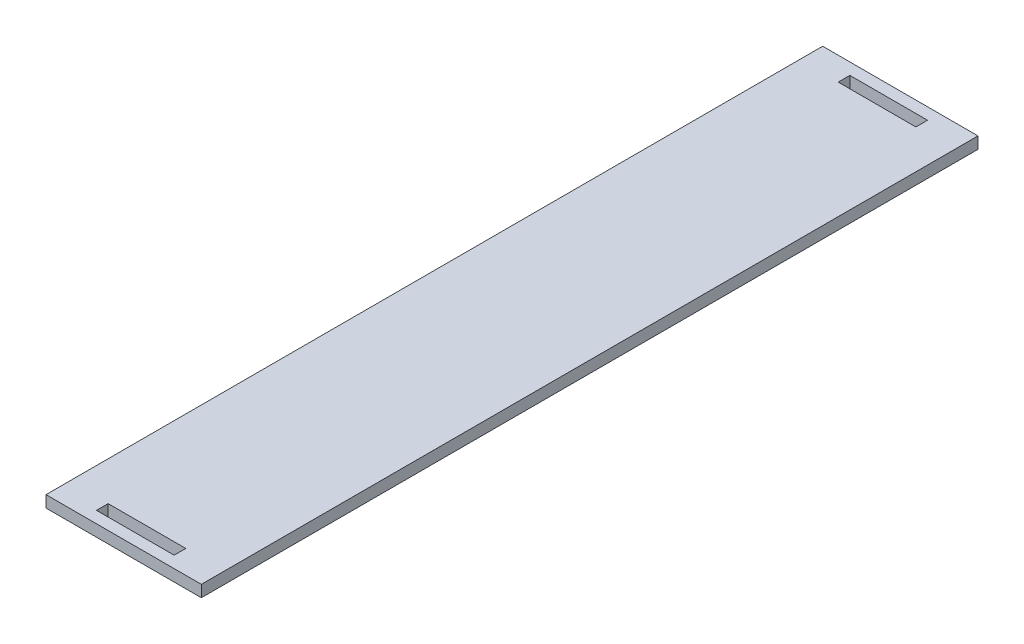
ISO-10303-21;
HEADER;
FILE_DESCRIPTION(('STEP AP214'),'2;1');
FILE_NAME('part.step','',(''),(''),'','','');
FILE_SCHEMA(('AUTOMOTIVE_DESIGN { 1 0 10303 214 1 1 1 1 }'));
ENDSEC;
DATA;
#1=APPLICATION_CONTEXT('core data for automotive mechanical design processes');
#2=APPLICATION_PROTOCOL_DEFINITION('international standard','automotive_design',2000,#1);
#3=PRODUCT_CONTEXT('',#1,'mechanical');
#4=PRODUCT('Part','Part','',(#3));
#5=PRODUCT_RELATED_PRODUCT_CATEGORY('part','',(#4));
#6=PRODUCT_DEFINITION_FORMATION('','',#4);
#7=PRODUCT_DEFINITION_CONTEXT('part definition',#1,'design');
#8=PRODUCT_DEFINITION('design','',#6,#7);
#9=PRODUCT_DEFINITION_SHAPE('','',#8);
#10=(LENGTH_UNIT() NAMED_UNIT(*) SI_UNIT(.MILLI.,.METRE.));
#11=(NAMED_UNIT(*) PLANE_ANGLE_UNIT() SI_UNIT($,.RADIAN.));
#12=(NAMED_UNIT(*) SI_UNIT($,.STERADIAN.) SOLID_ANGLE_UNIT());
#13=UNCERTAINTY_MEASURE_WITH_UNIT(LENGTH_MEASURE(1.E-05),#10,'distance_accuracy_value','');
#14=(GEOMETRIC_REPRESENTATION_CONTEXT(3) GLOBAL_UNCERTAINTY_ASSIGNED_CONTEXT((#13)) GLOBAL_UNIT_ASSIGNED_CONTEXT((#10,
#11,#12)) REPRESENTATION_CONTEXT('',''));
#15=CARTESIAN_POINT('',(0.,0.,0.));
#16=DIRECTION('',(0.,0.,1.));
#17=DIRECTION('',(1.,0.,0.));
#18=AXIS2_PLACEMENT_3D('',#15,#16,#17);
#19=CARTESIAN_POINT('',(0.,3.,0.));
#20=DIRECTION('',(0.,-1.,0.));
#21=DIRECTION('',(0.,0.,-1.));
#22=AXIS2_PLACEMENT_3D('',#19,#20,#21);
#23=PLANE('',#22);
#24=DIRECTION('',(0.,0.,1.));
#25=VECTOR('',#24,1.);
#26=CARTESIAN_POINT('',(-10.,3.,94.));
#27=LINE('',#26,#25);
#28=CARTESIAN_POINT('',(-10.,3.,94.));
#29=VERTEX_POINT('',#28);
#30=CARTESIAN_POINT('',(-10.,3.,97.));
#31=VERTEX_POINT('',#30);
#32=EDGE_CURVE('E164',#29,#31,#27,.T.);
#33=ORIENTED_EDGE('',*,*,#32,.F.);
#34=DIRECTION('',(-1.,0.,0.));
#35=VECTOR('',#34,1.);
#36=CARTESIAN_POINT('',(9.99999999999997,3.,94.));
#37=LINE('',#36,#35);
#38=CARTESIAN_POINT('',(9.99999999999997,3.,94.));
#39=VERTEX_POINT('',#38);
#40=EDGE_CURVE('E172',#39,#29,#37,.T.);
#41=ORIENTED_EDGE('',*,*,#40,.F.);
#42=DIRECTION('',(0.,0.,-1.));
#43=VECTOR('',#42,1.);
#44=CARTESIAN_POINT('',(9.99999999999997,3.,94.));
#45=LINE('',#44,#43);
#46=CARTESIAN_POINT('',(9.99999999999997,3.,97.));
#47=VERTEX_POINT('',#46);
#48=EDGE_CURVE('E169',#47,#39,#45,.T.);
#49=ORIENTED_EDGE('',*,*,#48,.F.);
#50=DIRECTION('',(1.,0.,0.));
#51=VECTOR('',#50,1.);
#52=CARTESIAN_POINT('',(9.99999999999997,3.,97.));
#53=LINE('',#52,#51);
#54=EDGE_CURVE('E166',#31,#47,#53,.T.);
#55=ORIENTED_EDGE('',*,*,#54,.F.);
#56=EDGE_LOOP('',(#33,#41,#49,#55));
#57=FACE_BOUND('',#56,.T.);
#58=DIRECTION('',(0.,0.,1.));
#59=VECTOR('',#58,1.);
#60=CARTESIAN_POINT('',(-20.,3.,-100.));
#61=LINE('',#60,#59);
#62=CARTESIAN_POINT('',(-20.,3.,-100.));
#63=VERTEX_POINT('',#62);
#64=CARTESIAN_POINT('',(-20.,3.,100.));
#65=VERTEX_POINT('',#64);
#66=EDGE_CURVE('E195',#63,#65,#61,.T.);
#67=ORIENTED_EDGE('',*,*,#66,.T.);
#68=DIRECTION('',(1.,0.,0.));
#69=VECTOR('',#68,1.);
#70=CARTESIAN_POINT('',(20.,3.,100.));
#71=LINE('',#70,#69);
#72=CARTESIAN_POINT('',(20.,3.,100.));
#73=VERTEX_POINT('',#72);
#74=EDGE_CURVE('E198',#65,#73,#71,.T.);
#75=ORIENTED_EDGE('',*,*,#74,.T.);
#76=DIRECTION('',(0.,0.,-1.));
#77=VECTOR('',#76,1.);
#78=CARTESIAN_POINT('',(20.,3.,-100.));
#79=LINE('',#78,#77);
#80=CARTESIAN_POINT('',(20.,3.,-100.));
#81=VERTEX_POINT('',#80);
#82=EDGE_CURVE('E201',#73,#81,#79,.T.);
#83=ORIENTED_EDGE('',*,*,#82,.T.);
#84=DIRECTION('',(-1.,0.,0.));
#85=VECTOR('',#84,1.);
#86=CARTESIAN_POINT('',(20.,3.,-100.));
#87=LINE('',#86,#85);
#88=EDGE_CURVE('E203',#81,#63,#87,.T.);
#89=ORIENTED_EDGE('',*,*,#88,.T.);
#90=EDGE_LOOP('',(#67,#75,#83,#89));
#91=FACE_BOUND('',#90,.T.);
#92=DIRECTION('',(0.,0.,-1.));
#93=VECTOR('',#92,1.);
#94=CARTESIAN_POINT('',(10.0000000000001,3.,-94.));
#95=LINE('',#94,#93);
#96=CARTESIAN_POINT('',(10.0000000000001,3.,-94.));
#97=VERTEX_POINT('',#96);
#98=CARTESIAN_POINT('',(10.0000000000001,3.,-97.));
#99=VERTEX_POINT('',#98);
#100=EDGE_CURVE('E128',#97,#99,#95,.T.);
#101=ORIENTED_EDGE('',*,*,#100,.F.);
#102=DIRECTION('',(1.,0.,0.));
#103=VECTOR('',#102,1.);
#104=CARTESIAN_POINT('',(10.0000000000001,3.,-94.));
#105=LINE('',#104,#103);
#106=CARTESIAN_POINT('',(-9.9999999999999,3.,-94.));
#107=VERTEX_POINT('',#106);
#108=EDGE_CURVE('E150',#107,#97,#105,.T.);
#109=ORIENTED_EDGE('',*,*,#108,.F.);
#110=DIRECTION('',(0.,0.,1.));
#111=VECTOR('',#110,1.);
#112=CARTESIAN_POINT('',(-9.9999999999999,3.,-94.));
#113=LINE('',#112,#111);
#114=CARTESIAN_POINT('',(-9.99999999999989,3.,-97.));
#115=VERTEX_POINT('',#114);
#116=EDGE_CURVE('E148',#115,#107,#113,.T.);
#117=ORIENTED_EDGE('',*,*,#116,.F.);
#118=DIRECTION('',(-1.,0.,0.));
#119=VECTOR('',#118,1.);
#120=CARTESIAN_POINT('',(10.0000000000001,3.,-97.));
#121=LINE('',#120,#119);
#122=EDGE_CURVE('E136',#99,#115,#121,.T.);
#123=ORIENTED_EDGE('',*,*,#122,.F.);
#124=EDGE_LOOP('',(#101,#109,#117,#123));
#125=FACE_BOUND('',#124,.T.);
#126=ADVANCED_FACE('F39',(#57,#91,#125),#23,.F.);
#127=CARTESIAN_POINT('',(0.,0.,0.));
#128=DIRECTION('',(0.,-1.,0.));
#129=DIRECTION('',(0.,0.,-1.));
#130=AXIS2_PLACEMENT_3D('',#127,#128,#129);
#131=PLANE('',#130);
#132=DIRECTION('',(0.,0.,1.));
#133=VECTOR('',#132,1.);
#134=CARTESIAN_POINT('',(-20.,0.,-100.));
#135=LINE('',#134,#133);
#136=CARTESIAN_POINT('',(-20.,0.,-100.));
#137=VERTEX_POINT('',#136);
#138=CARTESIAN_POINT('',(-20.,0.,100.));
#139=VERTEX_POINT('',#138);
#140=EDGE_CURVE('E194',#137,#139,#135,.T.);
#141=ORIENTED_EDGE('',*,*,#140,.F.);
#142=DIRECTION('',(-1.,0.,0.));
#143=VECTOR('',#142,1.);
#144=CARTESIAN_POINT('',(20.,0.,-100.));
#145=LINE('',#144,#143);
#146=CARTESIAN_POINT('',(20.,0.,-100.));
#147=VERTEX_POINT('',#146);
#148=EDGE_CURVE('E199',#147,#137,#145,.T.);
#149=ORIENTED_EDGE('',*,*,#148,.F.);
#150=DIRECTION('',(0.,0.,-1.));
#151=VECTOR('',#150,1.);
#152=CARTESIAN_POINT('',(20.,0.,-100.));
#153=LINE('',#152,#151);
#154=CARTESIAN_POINT('',(20.,0.,100.));
#155=VERTEX_POINT('',#154);
#156=EDGE_CURVE('E210',#155,#147,#153,.T.);
#157=ORIENTED_EDGE('',*,*,#156,.F.);
#158=DIRECTION('',(1.,0.,0.));
#159=VECTOR('',#158,1.);
#160=CARTESIAN_POINT('',(20.,0.,100.));
#161=LINE('',#160,#159);
#162=EDGE_CURVE('E208',#139,#155,#161,.T.);
#163=ORIENTED_EDGE('',*,*,#162,.F.);
#164=EDGE_LOOP('',(#141,#149,#157,#163));
#165=FACE_BOUND('',#164,.T.);
#166=DIRECTION('',(-1.,0.,0.));
#167=VECTOR('',#166,1.);
#168=CARTESIAN_POINT('',(9.99999999999997,0.,94.));
#169=LINE('',#168,#167);
#170=CARTESIAN_POINT('',(9.99999999999997,0.,94.));
#171=VERTEX_POINT('',#170);
#172=CARTESIAN_POINT('',(-10.,0.,94.));
#173=VERTEX_POINT('',#172);
#174=EDGE_CURVE('E167',#171,#173,#169,.T.);
#175=ORIENTED_EDGE('',*,*,#174,.T.);
#176=DIRECTION('',(0.,0.,1.));
#177=VECTOR('',#176,1.);
#178=CARTESIAN_POINT('',(-10.,0.,94.));
#179=LINE('',#178,#177);
#180=CARTESIAN_POINT('',(-10.,0.,97.));
#181=VERTEX_POINT('',#180);
#182=EDGE_CURVE('E144',#173,#181,#179,.T.);
#183=ORIENTED_EDGE('',*,*,#182,.T.);
#184=DIRECTION('',(1.,0.,0.));
#185=VECTOR('',#184,1.);
#186=CARTESIAN_POINT('',(9.99999999999997,0.,97.));
#187=LINE('',#186,#185);
#188=CARTESIAN_POINT('',(9.99999999999997,0.,97.));
#189=VERTEX_POINT('',#188);
#190=EDGE_CURVE('E177',#181,#189,#187,.T.);
#191=ORIENTED_EDGE('',*,*,#190,.T.);
#192=DIRECTION('',(0.,0.,-1.));
#193=VECTOR('',#192,1.);
#194=CARTESIAN_POINT('',(9.99999999999997,0.,94.));
#195=LINE('',#194,#193);
#196=EDGE_CURVE('E180',#189,#171,#195,.T.);
#197=ORIENTED_EDGE('',*,*,#196,.T.);
#198=EDGE_LOOP('',(#175,#183,#191,#197));
#199=FACE_BOUND('',#198,.T.);
#200=DIRECTION('',(1.,0.,0.));
#201=VECTOR('',#200,1.);
#202=CARTESIAN_POINT('',(10.0000000000001,0.,-94.));
#203=LINE('',#202,#201);
#204=CARTESIAN_POINT('',(-9.9999999999999,0.,-94.));
#205=VERTEX_POINT('',#204);
#206=CARTESIAN_POINT('',(10.0000000000001,0.,-94.));
#207=VERTEX_POINT('',#206);
#208=EDGE_CURVE('E137',#205,#207,#203,.T.);
#209=ORIENTED_EDGE('',*,*,#208,.T.);
#210=DIRECTION('',(0.,0.,-1.));
#211=VECTOR('',#210,1.);
#212=CARTESIAN_POINT('',(10.0000000000001,0.,-94.));
#213=LINE('',#212,#211);
#214=CARTESIAN_POINT('',(10.0000000000001,0.,-97.));
#215=VERTEX_POINT('',#214);
#216=EDGE_CURVE('E62',#207,#215,#213,.T.);
#217=ORIENTED_EDGE('',*,*,#216,.T.);
#218=DIRECTION('',(-1.,0.,0.));
#219=VECTOR('',#218,1.);
#220=CARTESIAN_POINT('',(10.0000000000001,0.,-97.));
#221=LINE('',#220,#219);
#222=CARTESIAN_POINT('',(-9.99999999999989,0.,-97.));
#223=VERTEX_POINT('',#222);
#224=EDGE_CURVE('E143',#215,#223,#221,.T.);
#225=ORIENTED_EDGE('',*,*,#224,.T.);
#226=DIRECTION('',(0.,0.,1.));
#227=VECTOR('',#226,1.);
#228=CARTESIAN_POINT('',(-9.9999999999999,0.,-94.));
#229=LINE('',#228,#227);
#230=EDGE_CURVE('E156',#223,#205,#229,.T.);
#231=ORIENTED_EDGE('',*,*,#230,.T.);
#232=EDGE_LOOP('',(#209,#217,#225,#231));
#233=FACE_BOUND('',#232,.T.);
#234=ADVANCED_FACE('F228',(#165,#199,#233),#131,.T.);
#235=CARTESIAN_POINT('',(-20.,3.,-100.));
#236=DIRECTION('',(1.,0.,0.));
#237=DIRECTION('',(0.,0.,-1.));
#238=AXIS2_PLACEMENT_3D('',#235,#236,#237);
#239=PLANE('',#238);
#240=ORIENTED_EDGE('',*,*,#140,.T.);
#241=DIRECTION('',(0.,-1.,0.));
#242=VECTOR('',#241,1.);
#243=CARTESIAN_POINT('',(-20.,3.,100.));
#244=LINE('',#243,#242);
#245=EDGE_CURVE('E11',#65,#139,#244,.T.);
#246=ORIENTED_EDGE('',*,*,#245,.F.);
#247=ORIENTED_EDGE('',*,*,#66,.F.);
#248=DIRECTION('',(0.,-1.,0.));
#249=VECTOR('',#248,1.);
#250=CARTESIAN_POINT('',(-20.,3.,-100.));
#251=LINE('',#250,#249);
#252=EDGE_CURVE('E205',#63,#137,#251,.T.);
#253=ORIENTED_EDGE('',*,*,#252,.T.);
#254=EDGE_LOOP('',(#240,#246,#247,#253));
#255=FACE_BOUND('',#254,.T.);
#256=ADVANCED_FACE('F41',(#255),#239,.F.);
#257=CARTESIAN_POINT('',(20.,3.,100.));
#258=DIRECTION('',(0.,0.,-1.));
#259=DIRECTION('',(-1.,0.,0.));
#260=AXIS2_PLACEMENT_3D('',#257,#258,#259);
#261=PLANE('',#260);
#262=ORIENTED_EDGE('',*,*,#162,.T.);
#263=DIRECTION('',(0.,-1.,0.));
#264=VECTOR('',#263,1.);
#265=CARTESIAN_POINT('',(20.,3.,100.));
#266=LINE('',#265,#264);
#267=EDGE_CURVE('E47',#73,#155,#266,.T.);
#268=ORIENTED_EDGE('',*,*,#267,.F.);
#269=ORIENTED_EDGE('',*,*,#74,.F.);
#270=ORIENTED_EDGE('',*,*,#245,.T.);
#271=EDGE_LOOP('',(#262,#268,#269,#270));
#272=FACE_BOUND('',#271,.T.);
#273=ADVANCED_FACE('F238',(#272),#261,.F.);
#274=CARTESIAN_POINT('',(20.,3.,-100.));
#275=DIRECTION('',(-1.,0.,0.));
#276=DIRECTION('',(0.,0.,1.));
#277=AXIS2_PLACEMENT_3D('',#274,#275,#276);
#278=PLANE('',#277);
#279=ORIENTED_EDGE('',*,*,#156,.T.);
#280=DIRECTION('',(0.,-1.,0.));
#281=VECTOR('',#280,1.);
#282=CARTESIAN_POINT('',(20.,3.,-100.));
#283=LINE('',#282,#281);
#284=EDGE_CURVE('E215',#81,#147,#283,.T.);
#285=ORIENTED_EDGE('',*,*,#284,.F.);
#286=ORIENTED_EDGE('',*,*,#82,.F.);
#287=ORIENTED_EDGE('',*,*,#267,.T.);
#288=EDGE_LOOP('',(#279,#285,#286,#287));
#289=FACE_BOUND('',#288,.T.);
#290=ADVANCED_FACE('F222',(#289),#278,.F.);
#291=CARTESIAN_POINT('',(20.,3.,-100.));
#292=DIRECTION('',(0.,0.,1.));
#293=DIRECTION('',(1.,0.,0.));
#294=AXIS2_PLACEMENT_3D('',#291,#292,#293);
#295=PLANE('',#294);
#296=ORIENTED_EDGE('',*,*,#148,.T.);
#297=ORIENTED_EDGE('',*,*,#252,.F.);
#298=ORIENTED_EDGE('',*,*,#88,.F.);
#299=ORIENTED_EDGE('',*,*,#284,.T.);
#300=EDGE_LOOP('',(#296,#297,#298,#299));
#301=FACE_BOUND('',#300,.T.);
#302=ADVANCED_FACE('F232',(#301),#295,.F.);
#303=CARTESIAN_POINT('',(-10.,3.,94.));
#304=DIRECTION('',(1.,0.,0.));
#305=DIRECTION('',(0.,0.,-1.));
#306=AXIS2_PLACEMENT_3D('',#303,#304,#305);
#307=PLANE('',#306);
#308=ORIENTED_EDGE('',*,*,#182,.F.);
#309=DIRECTION('',(0.,-1.,0.));
#310=VECTOR('',#309,1.);
#311=CARTESIAN_POINT('',(-10.,3.,94.));
#312=LINE('',#311,#310);
#313=EDGE_CURVE('E174',#29,#173,#312,.T.);
#314=ORIENTED_EDGE('',*,*,#313,.F.);
#315=ORIENTED_EDGE('',*,*,#32,.T.);
#316=DIRECTION('',(0.,-1.,0.));
#317=VECTOR('',#316,1.);
#318=CARTESIAN_POINT('',(-10.,3.,97.));
#319=LINE('',#318,#317);
#320=EDGE_CURVE('E191',#31,#181,#319,.T.);
#321=ORIENTED_EDGE('',*,*,#320,.T.);
#322=EDGE_LOOP('',(#308,#314,#315,#321));
#323=FACE_BOUND('',#322,.T.);
#324=ADVANCED_FACE('F254',(#323),#307,.T.);
#325=CARTESIAN_POINT('',(9.99999999999997,3.,97.));
#326=DIRECTION('',(0.,0.,-1.));
#327=DIRECTION('',(-1.,0.,0.));
#328=AXIS2_PLACEMENT_3D('',#325,#326,#327);
#329=PLANE('',#328);
#330=ORIENTED_EDGE('',*,*,#190,.F.);
#331=ORIENTED_EDGE('',*,*,#320,.F.);
#332=ORIENTED_EDGE('',*,*,#54,.T.);
#333=DIRECTION('',(0.,-1.,0.));
#334=VECTOR('',#333,1.);
#335=CARTESIAN_POINT('',(9.99999999999997,3.,97.));
#336=LINE('',#335,#334);
#337=EDGE_CURVE('E189',#47,#189,#336,.T.);
#338=ORIENTED_EDGE('',*,*,#337,.T.);
#339=EDGE_LOOP('',(#330,#331,#332,#338));
#340=FACE_BOUND('',#339,.T.);
#341=ADVANCED_FACE('F261',(#340),#329,.T.);
#342=CARTESIAN_POINT('',(9.99999999999997,3.,94.));
#343=DIRECTION('',(-1.,0.,0.));
#344=DIRECTION('',(0.,0.,1.));
#345=AXIS2_PLACEMENT_3D('',#342,#343,#344);
#346=PLANE('',#345);
#347=ORIENTED_EDGE('',*,*,#196,.F.);
#348=ORIENTED_EDGE('',*,*,#337,.F.);
#349=ORIENTED_EDGE('',*,*,#48,.T.);
#350=DIRECTION('',(0.,-1.,0.));
#351=VECTOR('',#350,1.);
#352=CARTESIAN_POINT('',(9.99999999999997,3.,94.));
#353=LINE('',#352,#351);
#354=EDGE_CURVE('E187',#39,#171,#353,.T.);
#355=ORIENTED_EDGE('',*,*,#354,.T.);
#356=EDGE_LOOP('',(#347,#348,#349,#355));
#357=FACE_BOUND('',#356,.T.);
#358=ADVANCED_FACE('F266',(#357),#346,.T.);
#359=CARTESIAN_POINT('',(9.99999999999997,3.,94.));
#360=DIRECTION('',(0.,0.,1.));
#361=DIRECTION('',(1.,0.,0.));
#362=AXIS2_PLACEMENT_3D('',#359,#360,#361);
#363=PLANE('',#362);
#364=ORIENTED_EDGE('',*,*,#174,.F.);
#365=ORIENTED_EDGE('',*,*,#354,.F.);
#366=ORIENTED_EDGE('',*,*,#40,.T.);
#367=ORIENTED_EDGE('',*,*,#313,.T.);
#368=EDGE_LOOP('',(#364,#365,#366,#367));
#369=FACE_BOUND('',#368,.T.);
#370=ADVANCED_FACE('F272',(#369),#363,.T.);
#371=CARTESIAN_POINT('',(10.0000000000001,3.,-94.));
#372=DIRECTION('',(-1.,0.,0.));
#373=DIRECTION('',(0.,0.,1.));
#374=AXIS2_PLACEMENT_3D('',#371,#372,#373);
#375=PLANE('',#374);
#376=ORIENTED_EDGE('',*,*,#216,.F.);
#377=DIRECTION('',(0.,-1.,0.));
#378=VECTOR('',#377,1.);
#379=CARTESIAN_POINT('',(10.0000000000001,3.,-94.));
#380=LINE('',#379,#378);
#381=EDGE_CURVE('E132',#97,#207,#380,.T.);
#382=ORIENTED_EDGE('',*,*,#381,.F.);
#383=ORIENTED_EDGE('',*,*,#100,.T.);
#384=DIRECTION('',(0.,-1.,0.));
#385=VECTOR('',#384,1.);
#386=CARTESIAN_POINT('',(10.0000000000001,3.,-97.));
#387=LINE('',#386,#385);
#388=EDGE_CURVE('E131',#99,#215,#387,.T.);
#389=ORIENTED_EDGE('',*,*,#388,.T.);
#390=EDGE_LOOP('',(#376,#382,#383,#389));
#391=FACE_BOUND('',#390,.T.);
#392=ADVANCED_FACE('F130',(#391),#375,.T.);
#393=CARTESIAN_POINT('',(10.0000000000001,3.,-97.));
#394=DIRECTION('',(0.,0.,1.));
#395=DIRECTION('',(1.,0.,0.));
#396=AXIS2_PLACEMENT_3D('',#393,#394,#395);
#397=PLANE('',#396);
#398=ORIENTED_EDGE('',*,*,#224,.F.);
#399=ORIENTED_EDGE('',*,*,#388,.F.);
#400=ORIENTED_EDGE('',*,*,#122,.T.);
#401=DIRECTION('',(0.,-1.,0.));
#402=VECTOR('',#401,1.);
#403=CARTESIAN_POINT('',(-9.99999999999989,3.,-97.));
#404=LINE('',#403,#402);
#405=EDGE_CURVE('E145',#115,#223,#404,.T.);
#406=ORIENTED_EDGE('',*,*,#405,.T.);
#407=EDGE_LOOP('',(#398,#399,#400,#406));
#408=FACE_BOUND('',#407,.T.);
#409=ADVANCED_FACE('F140',(#408),#397,.T.);
#410=CARTESIAN_POINT('',(-9.9999999999999,3.,-94.));
#411=DIRECTION('',(1.,0.,0.));
#412=DIRECTION('',(0.,0.,-1.));
#413=AXIS2_PLACEMENT_3D('',#410,#411,#412);
#414=PLANE('',#413);
#415=ORIENTED_EDGE('',*,*,#230,.F.);
#416=ORIENTED_EDGE('',*,*,#405,.F.);
#417=ORIENTED_EDGE('',*,*,#116,.T.);
#418=DIRECTION('',(0.,-1.,0.));
#419=VECTOR('',#418,1.);
#420=CARTESIAN_POINT('',(-9.9999999999999,3.,-94.));
#421=LINE('',#420,#419);
#422=EDGE_CURVE('E54',#107,#205,#421,.T.);
#423=ORIENTED_EDGE('',*,*,#422,.T.);
#424=EDGE_LOOP('',(#415,#416,#417,#423));
#425=FACE_BOUND('',#424,.T.);
#426=ADVANCED_FACE('F291',(#425),#414,.T.);
#427=CARTESIAN_POINT('',(10.0000000000001,3.,-94.));
#428=DIRECTION('',(0.,0.,-1.));
#429=DIRECTION('',(-1.,0.,0.));
#430=AXIS2_PLACEMENT_3D('',#427,#428,#429);
#431=PLANE('',#430);
#432=ORIENTED_EDGE('',*,*,#208,.F.);
#433=ORIENTED_EDGE('',*,*,#422,.F.);
#434=ORIENTED_EDGE('',*,*,#108,.T.);
#435=ORIENTED_EDGE('',*,*,#381,.T.);
#436=EDGE_LOOP('',(#432,#433,#434,#435));
#437=FACE_BOUND('',#436,.T.);
#438=ADVANCED_FACE('F294',(#437),#431,.T.);
#439=CLOSED_SHELL('',(#126,#234,#256,#273,#290,#302,#324,#341,#358,#370,#392,#409,#426,#438));
#440=MANIFOLD_SOLID_BREP('B2',#439);
#441=ADVANCED_BREP_SHAPE_REPRESENTATION('',(#18,#440),#14);
#442=SHAPE_DEFINITION_REPRESENTATION(#9,#441);
ENDSEC;
END-ISO-10303-21;
